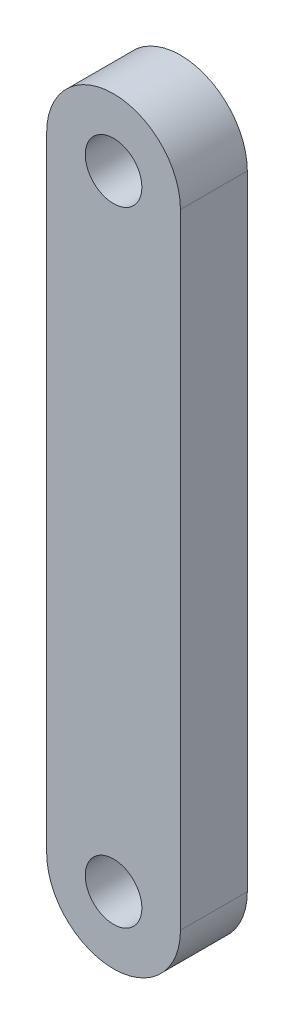
ISO-10303-21;
HEADER;
FILE_DESCRIPTION(('STEP AP214'),'2;1');
FILE_NAME('part.step','',(''),(''),'','','');
FILE_SCHEMA(('AUTOMOTIVE_DESIGN { 1 0 10303 214 1 1 1 1 }'));
ENDSEC;
DATA;
#1=APPLICATION_CONTEXT('core data for automotive mechanical design processes');
#2=APPLICATION_PROTOCOL_DEFINITION('international standard','automotive_design',2000,#1);
#3=PRODUCT_CONTEXT('',#1,'mechanical');
#4=PRODUCT('Part','Part','',(#3));
#5=PRODUCT_RELATED_PRODUCT_CATEGORY('part','',(#4));
#6=PRODUCT_DEFINITION_FORMATION('','',#4);
#7=PRODUCT_DEFINITION_CONTEXT('part definition',#1,'design');
#8=PRODUCT_DEFINITION('design','',#6,#7);
#9=PRODUCT_DEFINITION_SHAPE('','',#8);
#10=(LENGTH_UNIT() NAMED_UNIT(*) SI_UNIT(.MILLI.,.METRE.));
#11=(NAMED_UNIT(*) PLANE_ANGLE_UNIT() SI_UNIT($,.RADIAN.));
#12=(NAMED_UNIT(*) SI_UNIT($,.STERADIAN.) SOLID_ANGLE_UNIT());
#13=UNCERTAINTY_MEASURE_WITH_UNIT(LENGTH_MEASURE(1.E-05),#10,'distance_accuracy_value','');
#14=(GEOMETRIC_REPRESENTATION_CONTEXT(3) GLOBAL_UNCERTAINTY_ASSIGNED_CONTEXT((#13)) GLOBAL_UNIT_ASSIGNED_CONTEXT((#10,
#11,#12)) REPRESENTATION_CONTEXT('',''));
#15=CARTESIAN_POINT('',(0.,0.,0.));
#16=DIRECTION('',(0.,0.,1.));
#17=DIRECTION('',(1.,0.,0.));
#18=AXIS2_PLACEMENT_3D('',#15,#16,#17);
#19=CARTESIAN_POINT('',(0.,70.,7.5));
#20=DIRECTION('',(0.,0.,1.));
#21=DIRECTION('',(1.,0.,0.));
#22=AXIS2_PLACEMENT_3D('',#19,#20,#21);
#23=PLANE('',#22);
#24=CARTESIAN_POINT('',(0.,70.,7.5));
#25=DIRECTION('',(0.,0.,1.));
#26=DIRECTION('',(1.,0.,0.));
#27=AXIS2_PLACEMENT_3D('',#24,#25,#26);
#28=CIRCLE('',#27,3.175);
#29=CARTESIAN_POINT('',(3.175,70.,7.5));
#30=VERTEX_POINT('',#29);
#31=EDGE_CURVE('E98',#30,#30,#28,.T.);
#32=ORIENTED_EDGE('',*,*,#31,.F.);
#33=EDGE_LOOP('',(#32));
#34=FACE_BOUND('',#33,.T.);
#35=CARTESIAN_POINT('',(0.,70.,7.5));
#36=DIRECTION('',(0.,0.,1.));
#37=DIRECTION('',(1.,0.,0.));
#38=AXIS2_PLACEMENT_3D('',#35,#36,#37);
#39=CIRCLE('',#38,7.5);
#40=CARTESIAN_POINT('',(7.5,70.,7.5));
#41=VERTEX_POINT('',#40);
#42=CARTESIAN_POINT('',(-7.50000000000001,70.,7.5));
#43=VERTEX_POINT('',#42);
#44=EDGE_CURVE('E83',#41,#43,#39,.T.);
#45=ORIENTED_EDGE('',*,*,#44,.T.);
#46=DIRECTION('',(0.,-1.,0.));
#47=VECTOR('',#46,1.);
#48=CARTESIAN_POINT('',(-7.50000000000001,70.,7.5));
#49=LINE('',#48,#47);
#50=CARTESIAN_POINT('',(-7.5,0.,7.5));
#51=VERTEX_POINT('',#50);
#52=EDGE_CURVE('E78',#43,#51,#49,.T.);
#53=ORIENTED_EDGE('',*,*,#52,.T.);
#54=CARTESIAN_POINT('',(0.,0.,7.5));
#55=DIRECTION('',(0.,0.,1.));
#56=DIRECTION('',(1.,0.,0.));
#57=AXIS2_PLACEMENT_3D('',#54,#55,#56);
#58=CIRCLE('',#57,7.5);
#59=CARTESIAN_POINT('',(7.5,0.,7.5));
#60=VERTEX_POINT('',#59);
#61=EDGE_CURVE('E81',#51,#60,#58,.T.);
#62=ORIENTED_EDGE('',*,*,#61,.T.);
#63=DIRECTION('',(0.,1.,0.));
#64=VECTOR('',#63,1.);
#65=CARTESIAN_POINT('',(7.5,70.,7.5));
#66=LINE('',#65,#64);
#67=EDGE_CURVE('E48',#60,#41,#66,.T.);
#68=ORIENTED_EDGE('',*,*,#67,.T.);
#69=EDGE_LOOP('',(#45,#53,#62,#68));
#70=FACE_BOUND('',#69,.T.);
#71=CARTESIAN_POINT('',(0.,0.,7.5));
#72=DIRECTION('',(0.,0.,1.));
#73=DIRECTION('',(1.,0.,0.));
#74=AXIS2_PLACEMENT_3D('',#71,#72,#73);
#75=CIRCLE('',#74,3.175);
#76=CARTESIAN_POINT('',(3.175,0.,7.5));
#77=VERTEX_POINT('',#76);
#78=EDGE_CURVE('E113',#77,#77,#75,.T.);
#79=ORIENTED_EDGE('',*,*,#78,.F.);
#80=EDGE_LOOP('',(#79));
#81=FACE_BOUND('',#80,.T.);
#82=ADVANCED_FACE('F31',(#34,#70,#81),#23,.T.);
#83=CARTESIAN_POINT('',(0.,70.,0.));
#84=DIRECTION('',(0.,0.,1.));
#85=DIRECTION('',(1.,0.,0.));
#86=AXIS2_PLACEMENT_3D('',#83,#84,#85);
#87=PLANE('',#86);
#88=CARTESIAN_POINT('',(0.,70.,0.));
#89=DIRECTION('',(0.,0.,1.));
#90=DIRECTION('',(1.,0.,0.));
#91=AXIS2_PLACEMENT_3D('',#88,#89,#90);
#92=CIRCLE('',#91,3.175);
#93=CARTESIAN_POINT('',(3.175,70.,0.));
#94=VERTEX_POINT('',#93);
#95=EDGE_CURVE('E110',#94,#94,#92,.T.);
#96=ORIENTED_EDGE('',*,*,#95,.T.);
#97=EDGE_LOOP('',(#96));
#98=FACE_BOUND('',#97,.T.);
#99=CARTESIAN_POINT('',(0.,70.,0.));
#100=DIRECTION('',(0.,0.,1.));
#101=DIRECTION('',(1.,0.,0.));
#102=AXIS2_PLACEMENT_3D('',#99,#100,#101);
#103=CIRCLE('',#102,7.5);
#104=CARTESIAN_POINT('',(7.5,70.,0.));
#105=VERTEX_POINT('',#104);
#106=CARTESIAN_POINT('',(-7.50000000000001,70.,0.));
#107=VERTEX_POINT('',#106);
#108=EDGE_CURVE('E95',#105,#107,#103,.T.);
#109=ORIENTED_EDGE('',*,*,#108,.F.);
#110=DIRECTION('',(0.,1.,0.));
#111=VECTOR('',#110,1.);
#112=CARTESIAN_POINT('',(7.5,70.,0.));
#113=LINE('',#112,#111);
#114=CARTESIAN_POINT('',(7.5,0.,0.));
#115=VERTEX_POINT('',#114);
#116=EDGE_CURVE('E71',#115,#105,#113,.T.);
#117=ORIENTED_EDGE('',*,*,#116,.F.);
#118=CARTESIAN_POINT('',(0.,0.,0.));
#119=DIRECTION('',(0.,0.,1.));
#120=DIRECTION('',(1.,0.,0.));
#121=AXIS2_PLACEMENT_3D('',#118,#119,#120);
#122=CIRCLE('',#121,7.5);
#123=CARTESIAN_POINT('',(-7.5,0.,0.));
#124=VERTEX_POINT('',#123);
#125=EDGE_CURVE('E65',#124,#115,#122,.T.);
#126=ORIENTED_EDGE('',*,*,#125,.F.);
#127=DIRECTION('',(0.,-1.,0.));
#128=VECTOR('',#127,1.);
#129=CARTESIAN_POINT('',(-7.50000000000001,70.,0.));
#130=LINE('',#129,#128);
#131=EDGE_CURVE('E87',#107,#124,#130,.T.);
#132=ORIENTED_EDGE('',*,*,#131,.F.);
#133=EDGE_LOOP('',(#109,#117,#126,#132));
#134=FACE_BOUND('',#133,.T.);
#135=CARTESIAN_POINT('',(0.,0.,0.));
#136=DIRECTION('',(0.,0.,1.));
#137=DIRECTION('',(1.,0.,0.));
#138=AXIS2_PLACEMENT_3D('',#135,#136,#137);
#139=CIRCLE('',#138,3.175);
#140=CARTESIAN_POINT('',(3.175,0.,0.));
#141=VERTEX_POINT('',#140);
#142=EDGE_CURVE('E116',#141,#141,#139,.T.);
#143=ORIENTED_EDGE('',*,*,#142,.T.);
#144=EDGE_LOOP('',(#143));
#145=FACE_BOUND('',#144,.T.);
#146=ADVANCED_FACE('F106',(#98,#134,#145),#87,.F.);
#147=CARTESIAN_POINT('',(0.,70.,7.5));
#148=DIRECTION('',(0.,0.,-1.));
#149=DIRECTION('',(-1.,0.,0.));
#150=AXIS2_PLACEMENT_3D('',#147,#148,#149);
#151=CYLINDRICAL_SURFACE('',#150,7.5);
#152=ORIENTED_EDGE('',*,*,#108,.T.);
#153=DIRECTION('',(0.,0.,-1.));
#154=VECTOR('',#153,1.);
#155=CARTESIAN_POINT('',(-7.50000000000001,70.,7.5));
#156=LINE('',#155,#154);
#157=EDGE_CURVE('E11',#43,#107,#156,.T.);
#158=ORIENTED_EDGE('',*,*,#157,.F.);
#159=ORIENTED_EDGE('',*,*,#44,.F.);
#160=DIRECTION('',(0.,0.,-1.));
#161=VECTOR('',#160,1.);
#162=CARTESIAN_POINT('',(7.5,70.,7.5));
#163=LINE('',#162,#161);
#164=EDGE_CURVE('E91',#41,#105,#163,.T.);
#165=ORIENTED_EDGE('',*,*,#164,.T.);
#166=EDGE_LOOP('',(#152,#158,#159,#165));
#167=FACE_BOUND('',#166,.T.);
#168=ADVANCED_FACE('F33',(#167),#151,.T.);
#169=CARTESIAN_POINT('',(-7.50000000000001,70.,7.5));
#170=DIRECTION('',(1.,0.,0.));
#171=DIRECTION('',(0.,1.,0.));
#172=AXIS2_PLACEMENT_3D('',#169,#170,#171);
#173=PLANE('',#172);
#174=ORIENTED_EDGE('',*,*,#131,.T.);
#175=DIRECTION('',(0.,0.,-1.));
#176=VECTOR('',#175,1.);
#177=CARTESIAN_POINT('',(-7.5,0.,7.5));
#178=LINE('',#177,#176);
#179=EDGE_CURVE('E40',#51,#124,#178,.T.);
#180=ORIENTED_EDGE('',*,*,#179,.F.);
#181=ORIENTED_EDGE('',*,*,#52,.F.);
#182=ORIENTED_EDGE('',*,*,#157,.T.);
#183=EDGE_LOOP('',(#174,#180,#181,#182));
#184=FACE_BOUND('',#183,.T.);
#185=ADVANCED_FACE('F86',(#184),#173,.F.);
#186=CARTESIAN_POINT('',(0.,0.,7.5));
#187=DIRECTION('',(0.,0.,-1.));
#188=DIRECTION('',(-1.,0.,0.));
#189=AXIS2_PLACEMENT_3D('',#186,#187,#188);
#190=CYLINDRICAL_SURFACE('',#189,7.5);
#191=ORIENTED_EDGE('',*,*,#125,.T.);
#192=DIRECTION('',(0.,0.,-1.));
#193=VECTOR('',#192,1.);
#194=CARTESIAN_POINT('',(7.5,0.,7.5));
#195=LINE('',#194,#193);
#196=EDGE_CURVE('E88',#60,#115,#195,.T.);
#197=ORIENTED_EDGE('',*,*,#196,.F.);
#198=ORIENTED_EDGE('',*,*,#61,.F.);
#199=ORIENTED_EDGE('',*,*,#179,.T.);
#200=EDGE_LOOP('',(#191,#197,#198,#199));
#201=FACE_BOUND('',#200,.T.);
#202=ADVANCED_FACE('F89',(#201),#190,.T.);
#203=CARTESIAN_POINT('',(7.5,70.,7.5));
#204=DIRECTION('',(-1.,0.,0.));
#205=DIRECTION('',(0.,-1.,0.));
#206=AXIS2_PLACEMENT_3D('',#203,#204,#205);
#207=PLANE('',#206);
#208=ORIENTED_EDGE('',*,*,#116,.T.);
#209=ORIENTED_EDGE('',*,*,#164,.F.);
#210=ORIENTED_EDGE('',*,*,#67,.F.);
#211=ORIENTED_EDGE('',*,*,#196,.T.);
#212=EDGE_LOOP('',(#208,#209,#210,#211));
#213=FACE_BOUND('',#212,.T.);
#214=ADVANCED_FACE('F103',(#213),#207,.F.);
#215=CARTESIAN_POINT('',(0.,70.,7.5));
#216=DIRECTION('',(0.,0.,-1.));
#217=DIRECTION('',(-1.,0.,0.));
#218=AXIS2_PLACEMENT_3D('',#215,#216,#217);
#219=CYLINDRICAL_SURFACE('',#218,3.175);
#220=ORIENTED_EDGE('',*,*,#31,.T.);
#221=EDGE_LOOP('',(#220));
#222=FACE_BOUND('',#221,.T.);
#223=ORIENTED_EDGE('',*,*,#95,.F.);
#224=EDGE_LOOP('',(#223));
#225=FACE_BOUND('',#224,.T.);
#226=ADVANCED_FACE('F134',(#222,#225),#219,.F.);
#227=CARTESIAN_POINT('',(0.,0.,7.5));
#228=DIRECTION('',(0.,0.,-1.));
#229=DIRECTION('',(-1.,0.,0.));
#230=AXIS2_PLACEMENT_3D('',#227,#228,#229);
#231=CYLINDRICAL_SURFACE('',#230,3.175);
#232=ORIENTED_EDGE('',*,*,#78,.T.);
#233=EDGE_LOOP('',(#232));
#234=FACE_BOUND('',#233,.T.);
#235=ORIENTED_EDGE('',*,*,#142,.F.);
#236=EDGE_LOOP('',(#235));
#237=FACE_BOUND('',#236,.T.);
#238=ADVANCED_FACE('F122',(#234,#237),#231,.F.);
#239=CLOSED_SHELL('',(#82,#146,#168,#185,#202,#214,#226,#238));
#240=MANIFOLD_SOLID_BREP('B2',#239);
#241=ADVANCED_BREP_SHAPE_REPRESENTATION('',(#18,#240),#14);
#242=SHAPE_DEFINITION_REPRESENTATION(#9,#241);
ENDSEC;
END-ISO-10303-21;
